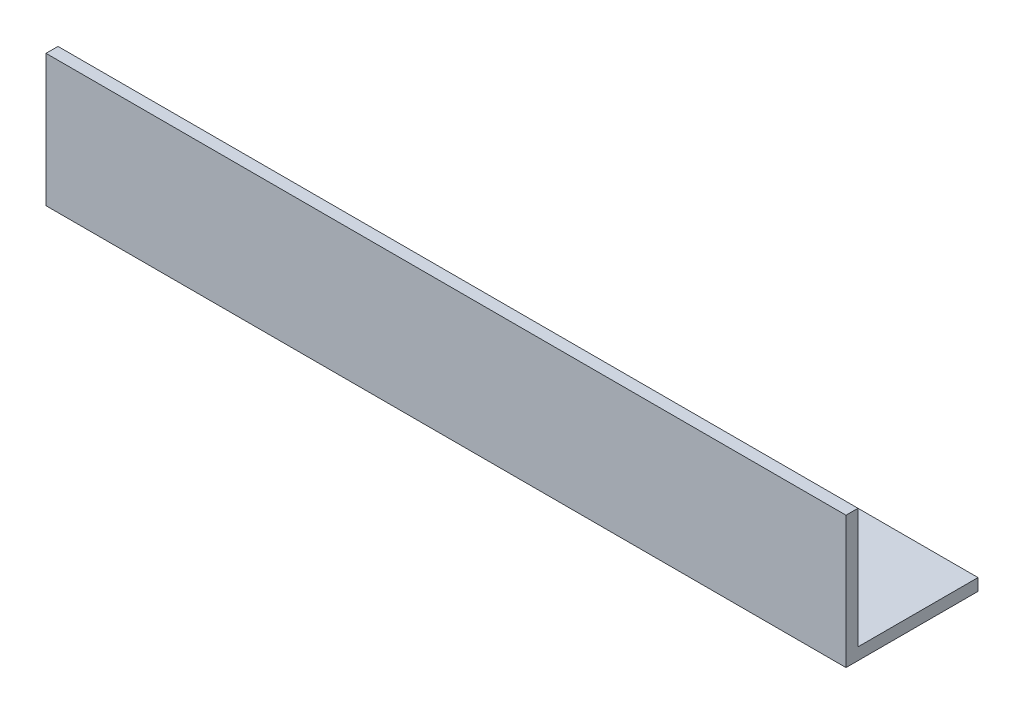
ISO-10303-21;
HEADER;
FILE_DESCRIPTION(('STEP AP214'),'2;1');
FILE_NAME('part.step','',(''),(''),'','','');
FILE_SCHEMA(('AUTOMOTIVE_DESIGN { 1 0 10303 214 1 1 1 1 }'));
ENDSEC;
DATA;
#1=APPLICATION_CONTEXT('core data for automotive mechanical design processes');
#2=APPLICATION_PROTOCOL_DEFINITION('international standard','automotive_design',2000,#1);
#3=PRODUCT_CONTEXT('',#1,'mechanical');
#4=PRODUCT('Part','Part','',(#3));
#5=PRODUCT_RELATED_PRODUCT_CATEGORY('part','',(#4));
#6=PRODUCT_DEFINITION_FORMATION('','',#4);
#7=PRODUCT_DEFINITION_CONTEXT('part definition',#1,'design');
#8=PRODUCT_DEFINITION('design','',#6,#7);
#9=PRODUCT_DEFINITION_SHAPE('','',#8);
#10=(LENGTH_UNIT() NAMED_UNIT(*) SI_UNIT(.MILLI.,.METRE.));
#11=(NAMED_UNIT(*) PLANE_ANGLE_UNIT() SI_UNIT($,.RADIAN.));
#12=(NAMED_UNIT(*) SI_UNIT($,.STERADIAN.) SOLID_ANGLE_UNIT());
#13=UNCERTAINTY_MEASURE_WITH_UNIT(LENGTH_MEASURE(1.E-05),#10,'distance_accuracy_value','');
#14=(GEOMETRIC_REPRESENTATION_CONTEXT(3) GLOBAL_UNCERTAINTY_ASSIGNED_CONTEXT((#13)) GLOBAL_UNIT_ASSIGNED_CONTEXT((#10,
#11,#12)) REPRESENTATION_CONTEXT('',''));
#15=CARTESIAN_POINT('',(0.,0.,0.));
#16=DIRECTION('',(0.,0.,1.));
#17=DIRECTION('',(1.,0.,0.));
#18=AXIS2_PLACEMENT_3D('',#15,#16,#17);
#19=CARTESIAN_POINT('',(200.,0.,0.));
#20=DIRECTION('',(0.,1.,0.));
#21=DIRECTION('',(0.,0.,1.));
#22=AXIS2_PLACEMENT_3D('',#19,#20,#21);
#23=PLANE('',#22);
#24=DIRECTION('',(0.,0.,-1.));
#25=VECTOR('',#24,1.);
#26=CARTESIAN_POINT('',(0.,0.,0.));
#27=LINE('',#26,#25);
#28=CARTESIAN_POINT('',(0.,0.,0.));
#29=VERTEX_POINT('',#28);
#30=CARTESIAN_POINT('',(0.,0.,-33.));
#31=VERTEX_POINT('',#30);
#32=EDGE_CURVE('E115',#29,#31,#27,.T.);
#33=ORIENTED_EDGE('',*,*,#32,.T.);
#34=DIRECTION('',(-1.,0.,0.));
#35=VECTOR('',#34,1.);
#36=CARTESIAN_POINT('',(200.,0.,-33.));
#37=LINE('',#36,#35);
#38=CARTESIAN_POINT('',(200.,0.,-33.));
#39=VERTEX_POINT('',#38);
#40=EDGE_CURVE('E11',#39,#31,#37,.T.);
#41=ORIENTED_EDGE('',*,*,#40,.F.);
#42=DIRECTION('',(0.,0.,-1.));
#43=VECTOR('',#42,1.);
#44=CARTESIAN_POINT('',(200.,0.,0.));
#45=LINE('',#44,#43);
#46=CARTESIAN_POINT('',(200.,0.,0.));
#47=VERTEX_POINT('',#46);
#48=EDGE_CURVE('E80',#47,#39,#45,.T.);
#49=ORIENTED_EDGE('',*,*,#48,.F.);
#50=DIRECTION('',(-1.,0.,0.));
#51=VECTOR('',#50,1.);
#52=CARTESIAN_POINT('',(200.,0.,0.));
#53=LINE('',#52,#51);
#54=EDGE_CURVE('E111',#47,#29,#53,.T.);
#55=ORIENTED_EDGE('',*,*,#54,.T.);
#56=EDGE_LOOP('',(#33,#41,#49,#55));
#57=FACE_BOUND('',#56,.T.);
#58=ADVANCED_FACE('F34',(#57),#23,.F.);
#59=CARTESIAN_POINT('',(200.,3.,-33.));
#60=DIRECTION('',(0.,0.,-1.));
#61=DIRECTION('',(-1.,0.,0.));
#62=AXIS2_PLACEMENT_3D('',#59,#60,#61);
#63=PLANE('',#62);
#64=DIRECTION('',(0.,-1.,0.));
#65=VECTOR('',#64,1.);
#66=CARTESIAN_POINT('',(0.,3.,-33.));
#67=LINE('',#66,#65);
#68=CARTESIAN_POINT('',(0.,3.,-33.));
#69=VERTEX_POINT('',#68);
#70=EDGE_CURVE('E118',#69,#31,#67,.T.);
#71=ORIENTED_EDGE('',*,*,#70,.F.);
#72=DIRECTION('',(-1.,0.,0.));
#73=VECTOR('',#72,1.);
#74=CARTESIAN_POINT('',(200.,3.,-33.));
#75=LINE('',#74,#73);
#76=CARTESIAN_POINT('',(200.,3.,-33.));
#77=VERTEX_POINT('',#76);
#78=EDGE_CURVE('E42',#77,#69,#75,.T.);
#79=ORIENTED_EDGE('',*,*,#78,.F.);
#80=DIRECTION('',(0.,-1.,0.));
#81=VECTOR('',#80,1.);
#82=CARTESIAN_POINT('',(200.,3.,-33.));
#83=LINE('',#82,#81);
#84=EDGE_CURVE('E204',#77,#39,#83,.T.);
#85=ORIENTED_EDGE('',*,*,#84,.T.);
#86=ORIENTED_EDGE('',*,*,#40,.T.);
#87=EDGE_LOOP('',(#71,#79,#85,#86));
#88=FACE_BOUND('',#87,.T.);
#89=ADVANCED_FACE('F136',(#88),#63,.T.);
#90=CARTESIAN_POINT('',(200.,3.,0.));
#91=DIRECTION('',(0.,1.,0.));
#92=DIRECTION('',(0.,0.,1.));
#93=AXIS2_PLACEMENT_3D('',#90,#91,#92);
#94=PLANE('',#93);
#95=DIRECTION('',(0.,0.,-1.));
#96=VECTOR('',#95,1.);
#97=CARTESIAN_POINT('',(0.,3.,0.));
#98=LINE('',#97,#96);
#99=CARTESIAN_POINT('',(0.,3.,-3.));
#100=VERTEX_POINT('',#99);
#101=EDGE_CURVE('E121',#100,#69,#98,.T.);
#102=ORIENTED_EDGE('',*,*,#101,.F.);
#103=DIRECTION('',(-1.,0.,0.));
#104=VECTOR('',#103,1.);
#105=CARTESIAN_POINT('',(200.,3.,-3.));
#106=LINE('',#105,#104);
#107=CARTESIAN_POINT('',(200.,3.,-3.));
#108=VERTEX_POINT('',#107);
#109=EDGE_CURVE('E101',#108,#100,#106,.T.);
#110=ORIENTED_EDGE('',*,*,#109,.F.);
#111=DIRECTION('',(0.,0.,-1.));
#112=VECTOR('',#111,1.);
#113=CARTESIAN_POINT('',(200.,3.,0.));
#114=LINE('',#113,#112);
#115=EDGE_CURVE('E107',#108,#77,#114,.T.);
#116=ORIENTED_EDGE('',*,*,#115,.T.);
#117=ORIENTED_EDGE('',*,*,#78,.T.);
#118=EDGE_LOOP('',(#102,#110,#116,#117));
#119=FACE_BOUND('',#118,.T.);
#120=ADVANCED_FACE('F133',(#119),#94,.T.);
#121=CARTESIAN_POINT('',(200.,33.,-3.));
#122=DIRECTION('',(0.,0.,-1.));
#123=DIRECTION('',(0.,1.,0.));
#124=AXIS2_PLACEMENT_3D('',#121,#122,#123);
#125=PLANE('',#124);
#126=DIRECTION('',(0.,-1.,0.));
#127=VECTOR('',#126,1.);
#128=CARTESIAN_POINT('',(0.,33.,-3.));
#129=LINE('',#128,#127);
#130=CARTESIAN_POINT('',(0.,33.,-3.));
#131=VERTEX_POINT('',#130);
#132=EDGE_CURVE('E96',#131,#100,#129,.T.);
#133=ORIENTED_EDGE('',*,*,#132,.F.);
#134=DIRECTION('',(-1.,0.,0.));
#135=VECTOR('',#134,1.);
#136=CARTESIAN_POINT('',(200.,33.,-3.));
#137=LINE('',#136,#135);
#138=CARTESIAN_POINT('',(200.,33.,-3.));
#139=VERTEX_POINT('',#138);
#140=EDGE_CURVE('E91',#139,#131,#137,.T.);
#141=ORIENTED_EDGE('',*,*,#140,.F.);
#142=DIRECTION('',(0.,-1.,0.));
#143=VECTOR('',#142,1.);
#144=CARTESIAN_POINT('',(200.,33.,-3.));
#145=LINE('',#144,#143);
#146=EDGE_CURVE('E94',#139,#108,#145,.T.);
#147=ORIENTED_EDGE('',*,*,#146,.T.);
#148=ORIENTED_EDGE('',*,*,#109,.T.);
#149=EDGE_LOOP('',(#133,#141,#147,#148));
#150=FACE_BOUND('',#149,.T.);
#151=ADVANCED_FACE('F93',(#150),#125,.T.);
#152=CARTESIAN_POINT('',(200.,33.,0.));
#153=DIRECTION('',(0.,1.,0.));
#154=DIRECTION('',(0.,0.,1.));
#155=AXIS2_PLACEMENT_3D('',#152,#153,#154);
#156=PLANE('',#155);
#157=DIRECTION('',(0.,0.,-1.));
#158=VECTOR('',#157,1.);
#159=CARTESIAN_POINT('',(0.,33.,0.));
#160=LINE('',#159,#158);
#161=CARTESIAN_POINT('',(0.,33.,0.));
#162=VERTEX_POINT('',#161);
#163=EDGE_CURVE('E125',#162,#131,#160,.T.);
#164=ORIENTED_EDGE('',*,*,#163,.F.);
#165=DIRECTION('',(-1.,0.,0.));
#166=VECTOR('',#165,1.);
#167=CARTESIAN_POINT('',(200.,33.,0.));
#168=LINE('',#167,#166);
#169=CARTESIAN_POINT('',(200.,33.,0.));
#170=VERTEX_POINT('',#169);
#171=EDGE_CURVE('E71',#170,#162,#168,.T.);
#172=ORIENTED_EDGE('',*,*,#171,.F.);
#173=DIRECTION('',(0.,0.,-1.));
#174=VECTOR('',#173,1.);
#175=CARTESIAN_POINT('',(200.,33.,0.));
#176=LINE('',#175,#174);
#177=EDGE_CURVE('E105',#170,#139,#176,.T.);
#178=ORIENTED_EDGE('',*,*,#177,.T.);
#179=ORIENTED_EDGE('',*,*,#140,.T.);
#180=EDGE_LOOP('',(#164,#172,#178,#179));
#181=FACE_BOUND('',#180,.T.);
#182=ADVANCED_FACE('F109',(#181),#156,.T.);
#183=CARTESIAN_POINT('',(200.,33.,0.));
#184=DIRECTION('',(0.,0.,-1.));
#185=DIRECTION('',(0.,1.,0.));
#186=AXIS2_PLACEMENT_3D('',#183,#184,#185);
#187=PLANE('',#186);
#188=DIRECTION('',(0.,-1.,0.));
#189=VECTOR('',#188,1.);
#190=CARTESIAN_POINT('',(0.,33.,0.));
#191=LINE('',#190,#189);
#192=EDGE_CURVE('E74',#162,#29,#191,.T.);
#193=ORIENTED_EDGE('',*,*,#192,.T.);
#194=ORIENTED_EDGE('',*,*,#54,.F.);
#195=DIRECTION('',(0.,-1.,0.));
#196=VECTOR('',#195,1.);
#197=CARTESIAN_POINT('',(200.,33.,0.));
#198=LINE('',#197,#196);
#199=EDGE_CURVE('E50',#170,#47,#198,.T.);
#200=ORIENTED_EDGE('',*,*,#199,.F.);
#201=ORIENTED_EDGE('',*,*,#171,.T.);
#202=EDGE_LOOP('',(#193,#194,#200,#201));
#203=FACE_BOUND('',#202,.T.);
#204=ADVANCED_FACE('F141',(#203),#187,.F.);
#205=CARTESIAN_POINT('',(200.,0.,0.));
#206=DIRECTION('',(-1.,0.,0.));
#207=DIRECTION('',(0.,0.,1.));
#208=AXIS2_PLACEMENT_3D('',#205,#206,#207);
#209=PLANE('',#208);
#210=ORIENTED_EDGE('',*,*,#48,.T.);
#211=ORIENTED_EDGE('',*,*,#84,.F.);
#212=ORIENTED_EDGE('',*,*,#115,.F.);
#213=ORIENTED_EDGE('',*,*,#146,.F.);
#214=ORIENTED_EDGE('',*,*,#177,.F.);
#215=ORIENTED_EDGE('',*,*,#199,.T.);
#216=EDGE_LOOP('',(#210,#211,#212,#213,#214,#215));
#217=FACE_BOUND('',#216,.T.);
#218=ADVANCED_FACE('F104',(#217),#209,.F.);
#219=CARTESIAN_POINT('',(0.,0.,0.));
#220=DIRECTION('',(-1.,0.,0.));
#221=DIRECTION('',(0.,0.,1.));
#222=AXIS2_PLACEMENT_3D('',#219,#220,#221);
#223=PLANE('',#222);
#224=ORIENTED_EDGE('',*,*,#32,.F.);
#225=ORIENTED_EDGE('',*,*,#192,.F.);
#226=ORIENTED_EDGE('',*,*,#163,.T.);
#227=ORIENTED_EDGE('',*,*,#132,.T.);
#228=ORIENTED_EDGE('',*,*,#101,.T.);
#229=ORIENTED_EDGE('',*,*,#70,.T.);
#230=EDGE_LOOP('',(#224,#225,#226,#227,#228,#229));
#231=FACE_BOUND('',#230,.T.);
#232=ADVANCED_FACE('F139',(#231),#223,.T.);
#233=CLOSED_SHELL('',(#58,#89,#120,#151,#182,#204,#218,#232));
#234=MANIFOLD_SOLID_BREP('B2',#233);
#235=ADVANCED_BREP_SHAPE_REPRESENTATION('',(#18,#234),#14);
#236=SHAPE_DEFINITION_REPRESENTATION(#9,#235);
ENDSEC;
END-ISO-10303-21;
